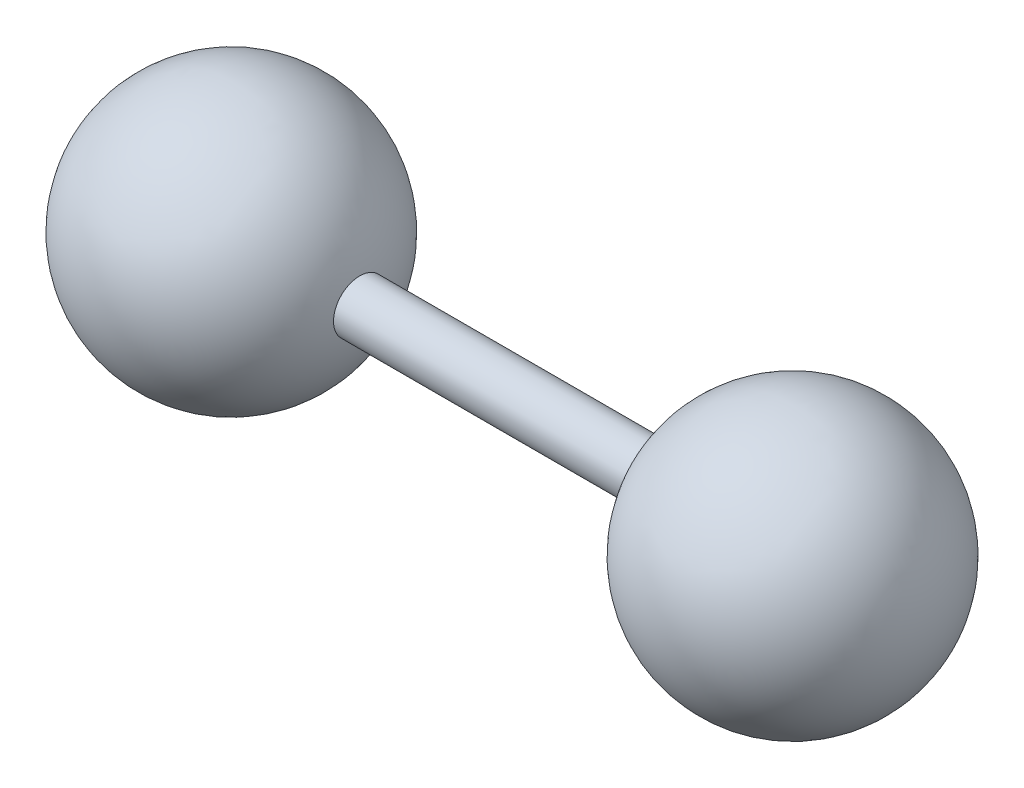
ISO-10303-21;
HEADER;
FILE_DESCRIPTION(('STEP AP214'),'2;1');
FILE_NAME('part.step','',(''),(''),'','','');
FILE_SCHEMA(('AUTOMOTIVE_DESIGN { 1 0 10303 214 1 1 1 1 }'));
ENDSEC;
DATA;
#1=APPLICATION_CONTEXT('core data for automotive mechanical design processes');
#2=APPLICATION_PROTOCOL_DEFINITION('international standard','automotive_design',2000,#1);
#3=PRODUCT_CONTEXT('',#1,'mechanical');
#4=PRODUCT('Part','Part','',(#3));
#5=PRODUCT_RELATED_PRODUCT_CATEGORY('part','',(#4));
#6=PRODUCT_DEFINITION_FORMATION('','',#4);
#7=PRODUCT_DEFINITION_CONTEXT('part definition',#1,'design');
#8=PRODUCT_DEFINITION('design','',#6,#7);
#9=PRODUCT_DEFINITION_SHAPE('','',#8);
#10=(LENGTH_UNIT() NAMED_UNIT(*) SI_UNIT(.MILLI.,.METRE.));
#11=(NAMED_UNIT(*) PLANE_ANGLE_UNIT() SI_UNIT($,.RADIAN.));
#12=(NAMED_UNIT(*) SI_UNIT($,.STERADIAN.) SOLID_ANGLE_UNIT());
#13=UNCERTAINTY_MEASURE_WITH_UNIT(LENGTH_MEASURE(1.E-05),#10,'distance_accuracy_value','');
#14=(GEOMETRIC_REPRESENTATION_CONTEXT(3) GLOBAL_UNCERTAINTY_ASSIGNED_CONTEXT((#13)) GLOBAL_UNIT_ASSIGNED_CONTEXT((#10,
#11,#12)) REPRESENTATION_CONTEXT('',''));
#15=CARTESIAN_POINT('',(0.,0.,0.));
#16=DIRECTION('',(0.,0.,1.));
#17=DIRECTION('',(1.,0.,0.));
#18=AXIS2_PLACEMENT_3D('',#15,#16,#17);
#19=CARTESIAN_POINT('',(-1326.68927840816,0.,0.));
#20=DIRECTION('',(1.,0.,0.));
#21=DIRECTION('',(0.,0.,-1.));
#22=AXIS2_PLACEMENT_3D('',#19,#20,#21);
#23=CYLINDRICAL_SURFACE('',#22,75.);
#24=CARTESIAN_POINT('',(-1289.56762240169,0.,0.));
#25=DIRECTION('',(-1.,0.,0.));
#26=DIRECTION('',(0.,0.,1.));
#27=AXIS2_PLACEMENT_3D('',#24,#25,#26);
#28=CIRCLE('',#27,75.);
#29=CARTESIAN_POINT('',(-1289.56762240169,0.,75.));
#30=VERTEX_POINT('',#29);
#31=EDGE_CURVE('E10',#30,#30,#28,.T.);
#32=ORIENTED_EDGE('',*,*,#31,.F.);
#33=EDGE_LOOP('',(#32));
#34=FACE_BOUND('',#33,.T.);
#35=CARTESIAN_POINT('',(-419.11826515137,0.,0.));
#36=DIRECTION('',(1.,0.,0.));
#37=DIRECTION('',(0.,0.,-1.));
#38=AXIS2_PLACEMENT_3D('',#35,#36,#37);
#39=CIRCLE('',#38,75.);
#40=CARTESIAN_POINT('',(-419.11826515137,0.,-75.));
#41=VERTEX_POINT('',#40);
#42=EDGE_CURVE('E46',#41,#41,#39,.T.);
#43=ORIENTED_EDGE('',*,*,#42,.F.);
#44=EDGE_LOOP('',(#43));
#45=FACE_BOUND('',#44,.T.);
#46=ADVANCED_FACE('F39',(#34,#45),#23,.T.);
#47=CARTESIAN_POINT('',(-51.4211307373518,0.,0.));
#48=DIRECTION('',(-1.,0.,0.));
#49=DIRECTION('',(0.,1.,0.));
#50=AXIS2_PLACEMENT_3D('',#47,#48,#49);
#51=SPHERICAL_SURFACE('',#50,375.26814767081);
#52=ORIENTED_EDGE('',*,*,#42,.T.);
#53=EDGE_LOOP('',(#52));
#54=FACE_BOUND('',#53,.T.);
#55=ADVANCED_FACE('F41',(#54),#51,.T.);
#56=CARTESIAN_POINT('',(-1656.99108381916,0.,0.));
#57=DIRECTION('',(1.,0.,0.));
#58=DIRECTION('',(0.,1.,0.));
#59=AXIS2_PLACEMENT_3D('',#56,#57,#58);
#60=SPHERICAL_SURFACE('',#59,375.);
#61=ORIENTED_EDGE('',*,*,#31,.T.);
#62=EDGE_LOOP('',(#61));
#63=FACE_BOUND('',#62,.T.);
#64=ADVANCED_FACE('F58',(#63),#60,.T.);
#65=CLOSED_SHELL('',(#46,#55,#64));
#66=MANIFOLD_SOLID_BREP('B2',#65);
#67=ADVANCED_BREP_SHAPE_REPRESENTATION('',(#18,#66),#14);
#68=SHAPE_DEFINITION_REPRESENTATION(#9,#67);
ENDSEC;
END-ISO-10303-21;
